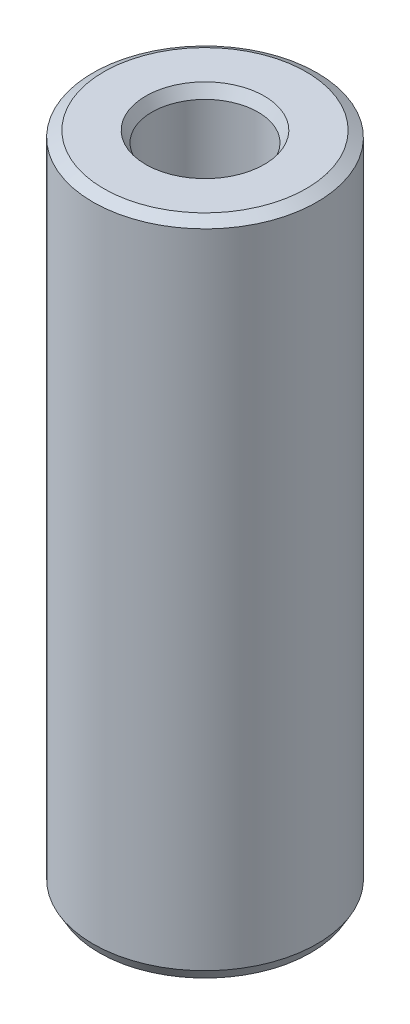
ISO-10303-21;
HEADER;
FILE_DESCRIPTION(('STEP AP214'),'2;1');
FILE_NAME('part.step','',(''),(''),'','','');
FILE_SCHEMA(('AUTOMOTIVE_DESIGN { 1 0 10303 214 1 1 1 1 }'));
ENDSEC;
DATA;
#1=APPLICATION_CONTEXT('core data for automotive mechanical design processes');
#2=APPLICATION_PROTOCOL_DEFINITION('international standard','automotive_design',2000,#1);
#3=PRODUCT_CONTEXT('',#1,'mechanical');
#4=PRODUCT('Part','Part','',(#3));
#5=PRODUCT_RELATED_PRODUCT_CATEGORY('part','',(#4));
#6=PRODUCT_DEFINITION_FORMATION('','',#4);
#7=PRODUCT_DEFINITION_CONTEXT('part definition',#1,'design');
#8=PRODUCT_DEFINITION('design','',#6,#7);
#9=PRODUCT_DEFINITION_SHAPE('','',#8);
#10=(LENGTH_UNIT() NAMED_UNIT(*) SI_UNIT(.MILLI.,.METRE.));
#11=(NAMED_UNIT(*) PLANE_ANGLE_UNIT() SI_UNIT($,.RADIAN.));
#12=(NAMED_UNIT(*) SI_UNIT($,.STERADIAN.) SOLID_ANGLE_UNIT());
#13=UNCERTAINTY_MEASURE_WITH_UNIT(LENGTH_MEASURE(1.E-05),#10,'distance_accuracy_value','');
#14=(GEOMETRIC_REPRESENTATION_CONTEXT(3) GLOBAL_UNCERTAINTY_ASSIGNED_CONTEXT((#13)) GLOBAL_UNIT_ASSIGNED_CONTEXT((#10,
#11,#12)) REPRESENTATION_CONTEXT('',''));
#15=CARTESIAN_POINT('',(0.,0.,0.));
#16=DIRECTION('',(0.,0.,1.));
#17=DIRECTION('',(1.,0.,0.));
#18=AXIS2_PLACEMENT_3D('',#15,#16,#17);
#19=CARTESIAN_POINT('',(0.,309.060092193171,0.));
#20=DIRECTION('',(0.,-1.,0.));
#21=DIRECTION('',(0.,0.,-1.));
#22=AXIS2_PLACEMENT_3D('',#19,#20,#21);
#23=CYLINDRICAL_SURFACE('',#22,52.5);
#24=CARTESIAN_POINT('',(0.,5.05659613101173,0.));
#25=DIRECTION('',(0.,1.,0.));
#26=DIRECTION('',(0.,0.,1.));
#27=AXIS2_PLACEMENT_3D('',#24,#25,#26);
#28=CIRCLE('',#27,52.5);
#29=CARTESIAN_POINT('',(0.,5.05659613101173,52.5));
#30=VERTEX_POINT('',#29);
#31=EDGE_CURVE('E10',#30,#30,#28,.T.);
#32=ORIENTED_EDGE('',*,*,#31,.T.);
#33=EDGE_LOOP('',(#32));
#34=FACE_BOUND('',#33,.T.);
#35=CARTESIAN_POINT('',(0.,306.140665055748,0.));
#36=DIRECTION('',(0.,1.,0.));
#37=DIRECTION('',(0.,0.,1.));
#38=AXIS2_PLACEMENT_3D('',#35,#36,#37);
#39=CIRCLE('',#38,52.5);
#40=CARTESIAN_POINT('',(0.,306.140665055748,52.5));
#41=VERTEX_POINT('',#40);
#42=EDGE_CURVE('E50',#41,#41,#39,.F.);
#43=ORIENTED_EDGE('',*,*,#42,.T.);
#44=EDGE_LOOP('',(#43));
#45=FACE_BOUND('',#44,.T.);
#46=ADVANCED_FACE('F39',(#34,#45),#23,.T.);
#47=CARTESIAN_POINT('',(0.,309.060092193171,0.));
#48=DIRECTION('',(0.,1.,0.));
#49=DIRECTION('',(0.,0.,1.));
#50=AXIS2_PLACEMENT_3D('',#47,#48,#49);
#51=PLANE('',#50);
#52=CARTESIAN_POINT('',(0.,309.060092193171,0.));
#53=DIRECTION('',(0.,1.,0.));
#54=DIRECTION('',(0.,0.,1.));
#55=AXIS2_PLACEMENT_3D('',#52,#53,#54);
#56=CIRCLE('',#55,27.7908376221429);
#57=CARTESIAN_POINT('',(0.,309.060092193171,27.7908376221429));
#58=VERTEX_POINT('',#57);
#59=EDGE_CURVE('E58',#58,#58,#56,.F.);
#60=ORIENTED_EDGE('',*,*,#59,.T.);
#61=EDGE_LOOP('',(#60));
#62=FACE_BOUND('',#61,.T.);
#63=CARTESIAN_POINT('',(0.,309.060092193171,0.));
#64=DIRECTION('',(0.,1.,0.));
#65=DIRECTION('',(0.,0.,1.));
#66=AXIS2_PLACEMENT_3D('',#63,#64,#65);
#67=CIRCLE('',#66,47.4434038689883);
#68=CARTESIAN_POINT('',(0.,309.060092193171,47.4434038689883));
#69=VERTEX_POINT('',#68);
#70=EDGE_CURVE('E61',#69,#69,#67,.T.);
#71=ORIENTED_EDGE('',*,*,#70,.T.);
#72=EDGE_LOOP('',(#71));
#73=FACE_BOUND('',#72,.T.);
#74=ADVANCED_FACE('F88',(#62,#73),#51,.T.);
#75=CARTESIAN_POINT('',(0.,0.,0.));
#76=DIRECTION('',(0.,1.,0.));
#77=DIRECTION('',(0.,0.,1.));
#78=AXIS2_PLACEMENT_3D('',#75,#76,#77);
#79=PLANE('',#78);
#80=CARTESIAN_POINT('',(0.,0.,0.));
#81=DIRECTION('',(0.,1.,0.));
#82=DIRECTION('',(0.,0.,1.));
#83=AXIS2_PLACEMENT_3D('',#80,#81,#82);
#84=CIRCLE('',#83,29.9280066157319);
#85=CARTESIAN_POINT('',(0.,0.,29.9280066157319));
#86=VERTEX_POINT('',#85);
#87=EDGE_CURVE('E51',#86,#86,#84,.T.);
#88=ORIENTED_EDGE('',*,*,#87,.T.);
#89=EDGE_LOOP('',(#88));
#90=FACE_BOUND('',#89,.T.);
#91=CARTESIAN_POINT('',(0.,0.,0.));
#92=DIRECTION('',(0.,1.,0.));
#93=DIRECTION('',(0.,0.,1.));
#94=AXIS2_PLACEMENT_3D('',#91,#92,#93);
#95=CIRCLE('',#94,49.5805728625771);
#96=CARTESIAN_POINT('',(0.,0.,49.5805728625771));
#97=VERTEX_POINT('',#96);
#98=EDGE_CURVE('E54',#97,#97,#95,.F.);
#99=ORIENTED_EDGE('',*,*,#98,.T.);
#100=EDGE_LOOP('',(#99));
#101=FACE_BOUND('',#100,.T.);
#102=ADVANCED_FACE('F83',(#90,#101),#79,.F.);
#103=CARTESIAN_POINT('',(0.,309.060092193171,0.));
#104=DIRECTION('',(0.,-1.,0.));
#105=DIRECTION('',(0.,0.,-1.));
#106=AXIS2_PLACEMENT_3D('',#103,#104,#105);
#107=CYLINDRICAL_SURFACE('',#106,24.8714104847201);
#108=CARTESIAN_POINT('',(0.,304.003496062159,0.));
#109=DIRECTION('',(0.,1.,0.));
#110=DIRECTION('',(0.,0.,1.));
#111=AXIS2_PLACEMENT_3D('',#108,#109,#110);
#112=CIRCLE('',#111,24.8714104847201);
#113=CARTESIAN_POINT('',(0.,304.003496062159,24.8714104847201));
#114=VERTEX_POINT('',#113);
#115=EDGE_CURVE('E67',#114,#114,#112,.T.);
#116=ORIENTED_EDGE('',*,*,#115,.T.);
#117=EDGE_LOOP('',(#116));
#118=FACE_BOUND('',#117,.T.);
#119=CARTESIAN_POINT('',(0.,2.91942713742288,0.));
#120=DIRECTION('',(0.,1.,0.));
#121=DIRECTION('',(0.,0.,1.));
#122=AXIS2_PLACEMENT_3D('',#119,#120,#121);
#123=CIRCLE('',#122,24.8714104847201);
#124=CARTESIAN_POINT('',(0.,2.91942713742288,24.8714104847201));
#125=VERTEX_POINT('',#124);
#126=EDGE_CURVE('E69',#125,#125,#123,.F.);
#127=ORIENTED_EDGE('',*,*,#126,.T.);
#128=EDGE_LOOP('',(#127));
#129=FACE_BOUND('',#128,.T.);
#130=ADVANCED_FACE('F71',(#118,#129),#107,.F.);
#131=CARTESIAN_POINT('',(0.,304.003496062159,0.));
#132=DIRECTION('',(0.,1.,0.));
#133=DIRECTION('',(0.,0.,1.));
#134=AXIS2_PLACEMENT_3D('',#131,#132,#133);
#135=CONICAL_SURFACE('',#134,24.8714104847201,0.5235987755983);
#136=ORIENTED_EDGE('',*,*,#59,.F.);
#137=EDGE_LOOP('',(#136));
#138=FACE_BOUND('',#137,.T.);
#139=ORIENTED_EDGE('',*,*,#115,.F.);
#140=EDGE_LOOP('',(#139));
#141=FACE_BOUND('',#140,.T.);
#142=ADVANCED_FACE('F77',(#138,#141),#135,.F.);
#143=CARTESIAN_POINT('',(0.,0.,0.));
#144=DIRECTION('',(0.,-1.,0.));
#145=DIRECTION('',(0.,0.,-1.));
#146=AXIS2_PLACEMENT_3D('',#143,#144,#145);
#147=CONICAL_SURFACE('',#146,29.9280066157319,1.0471975511966);
#148=ORIENTED_EDGE('',*,*,#126,.F.);
#149=EDGE_LOOP('',(#148));
#150=FACE_BOUND('',#149,.T.);
#151=ORIENTED_EDGE('',*,*,#87,.F.);
#152=EDGE_LOOP('',(#151));
#153=FACE_BOUND('',#152,.T.);
#154=ADVANCED_FACE('F73',(#150,#153),#147,.F.);
#155=CARTESIAN_POINT('',(0.,5.05659613101173,0.));
#156=DIRECTION('',(0.,1.,0.));
#157=DIRECTION('',(0.,0.,1.));
#158=AXIS2_PLACEMENT_3D('',#155,#156,#157);
#159=CONICAL_SURFACE('',#158,52.5,0.523598775598306);
#160=ORIENTED_EDGE('',*,*,#98,.F.);
#161=EDGE_LOOP('',(#160));
#162=FACE_BOUND('',#161,.T.);
#163=ORIENTED_EDGE('',*,*,#31,.F.);
#164=EDGE_LOOP('',(#163));
#165=FACE_BOUND('',#164,.T.);
#166=ADVANCED_FACE('F76',(#162,#165),#159,.T.);
#167=CARTESIAN_POINT('',(0.,309.060092193171,0.));
#168=DIRECTION('',(0.,-1.,0.));
#169=DIRECTION('',(0.,0.,-1.));
#170=AXIS2_PLACEMENT_3D('',#167,#168,#169);
#171=CONICAL_SURFACE('',#170,47.4434038689883,1.04719755119659);
#172=ORIENTED_EDGE('',*,*,#42,.F.);
#173=EDGE_LOOP('',(#172));
#174=FACE_BOUND('',#173,.T.);
#175=ORIENTED_EDGE('',*,*,#70,.F.);
#176=EDGE_LOOP('',(#175));
#177=FACE_BOUND('',#176,.T.);
#178=ADVANCED_FACE('F45',(#174,#177),#171,.T.);
#179=CLOSED_SHELL('',(#46,#74,#102,#130,#142,#154,#166,#178));
#180=MANIFOLD_SOLID_BREP('B2',#179);
#181=ADVANCED_BREP_SHAPE_REPRESENTATION('',(#18,#180),#14);
#182=SHAPE_DEFINITION_REPRESENTATION(#9,#181);
ENDSEC;
END-ISO-10303-21;
